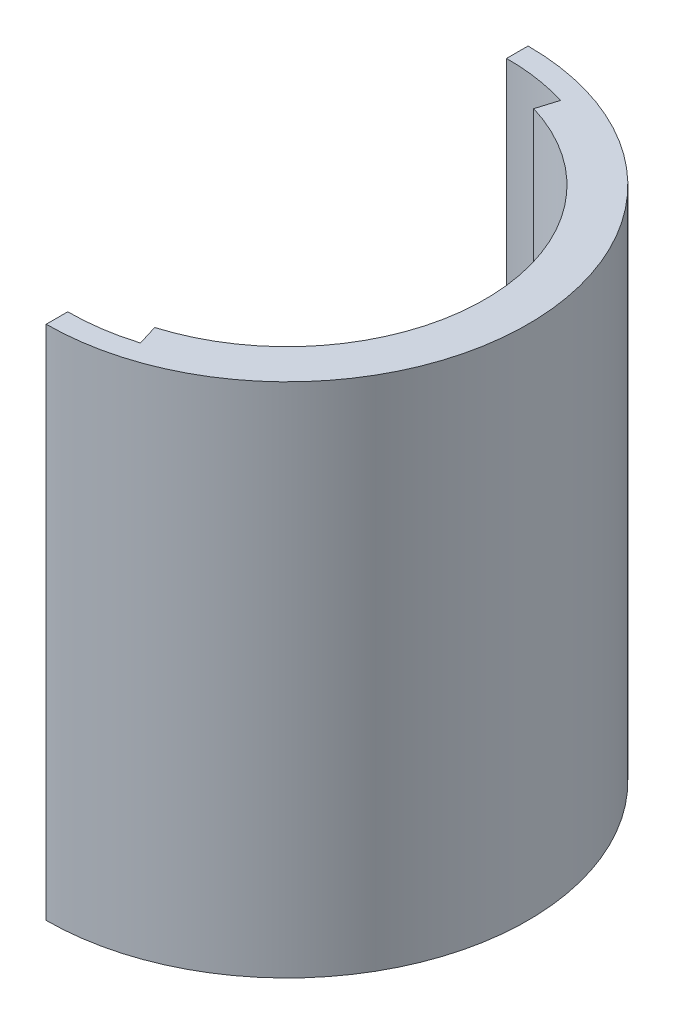
ISO-10303-21;
HEADER;
FILE_DESCRIPTION(('STEP AP214'),'2;1');
FILE_NAME('part.step','',(''),(''),'','','');
FILE_SCHEMA(('AUTOMOTIVE_DESIGN { 1 0 10303 214 1 1 1 1 }'));
ENDSEC;
DATA;
#1=APPLICATION_CONTEXT('core data for automotive mechanical design processes');
#2=APPLICATION_PROTOCOL_DEFINITION('international standard','automotive_design',2000,#1);
#3=PRODUCT_CONTEXT('',#1,'mechanical');
#4=PRODUCT('Part','Part','',(#3));
#5=PRODUCT_RELATED_PRODUCT_CATEGORY('part','',(#4));
#6=PRODUCT_DEFINITION_FORMATION('','',#4);
#7=PRODUCT_DEFINITION_CONTEXT('part definition',#1,'design');
#8=PRODUCT_DEFINITION('design','',#6,#7);
#9=PRODUCT_DEFINITION_SHAPE('','',#8);
#10=(LENGTH_UNIT() NAMED_UNIT(*) SI_UNIT(.MILLI.,.METRE.));
#11=(NAMED_UNIT(*) PLANE_ANGLE_UNIT() SI_UNIT($,.RADIAN.));
#12=(NAMED_UNIT(*) SI_UNIT($,.STERADIAN.) SOLID_ANGLE_UNIT());
#13=UNCERTAINTY_MEASURE_WITH_UNIT(LENGTH_MEASURE(1.E-05),#10,'distance_accuracy_value','');
#14=(GEOMETRIC_REPRESENTATION_CONTEXT(3) GLOBAL_UNCERTAINTY_ASSIGNED_CONTEXT((#13)) GLOBAL_UNIT_ASSIGNED_CONTEXT((#10,
#11,#12)) REPRESENTATION_CONTEXT('',''));
#15=CARTESIAN_POINT('',(0.,0.,0.));
#16=DIRECTION('',(0.,0.,1.));
#17=DIRECTION('',(1.,0.,0.));
#18=AXIS2_PLACEMENT_3D('',#15,#16,#17);
#19=CARTESIAN_POINT('',(0.,60.,0.));
#20=DIRECTION('',(0.,-1.,0.));
#21=DIRECTION('',(0.,0.,-1.));
#22=AXIS2_PLACEMENT_3D('',#19,#20,#21);
#23=CYLINDRICAL_SURFACE('',#22,23.);
#24=DIRECTION('',(0.,-1.,0.));
#25=VECTOR('',#24,1.);
#26=CARTESIAN_POINT('',(6.63401420516603,60.,22.0224852259152));
#27=LINE('',#26,#25);
#28=CARTESIAN_POINT('',(6.63401420516603,60.,22.0224852259152));
#29=VERTEX_POINT('',#28);
#30=CARTESIAN_POINT('',(6.63401420516603,0.,22.0224852259152));
#31=VERTEX_POINT('',#30);
#32=EDGE_CURVE('E52',#29,#31,#27,.T.);
#33=ORIENTED_EDGE('',*,*,#32,.F.);
#34=CARTESIAN_POINT('',(0.,60.,0.));
#35=DIRECTION('',(0.,-1.,0.));
#36=DIRECTION('',(0.,0.,-1.));
#37=AXIS2_PLACEMENT_3D('',#34,#35,#36);
#38=CIRCLE('',#37,23.);
#39=CARTESIAN_POINT('',(6.63401420516603,60.,-22.0224852259153));
#40=VERTEX_POINT('',#39);
#41=EDGE_CURVE('E128',#40,#29,#38,.T.);
#42=ORIENTED_EDGE('',*,*,#41,.F.);
#43=DIRECTION('',(0.,-1.,0.));
#44=VECTOR('',#43,1.);
#45=CARTESIAN_POINT('',(6.63401420516603,60.,-22.0224852259152));
#46=LINE('',#45,#44);
#47=CARTESIAN_POINT('',(6.63401420516603,0.,-22.0224852259152));
#48=VERTEX_POINT('',#47);
#49=EDGE_CURVE('E11',#40,#48,#46,.T.);
#50=ORIENTED_EDGE('',*,*,#49,.T.);
#51=CARTESIAN_POINT('',(0.,0.,0.));
#52=DIRECTION('',(0.,-1.,0.));
#53=DIRECTION('',(0.,0.,-1.));
#54=AXIS2_PLACEMENT_3D('',#51,#52,#53);
#55=CIRCLE('',#54,23.);
#56=EDGE_CURVE('E130',#48,#31,#55,.T.);
#57=ORIENTED_EDGE('',*,*,#56,.T.);
#58=EDGE_LOOP('',(#33,#42,#50,#57));
#59=FACE_BOUND('',#58,.T.);
#60=ADVANCED_FACE('F37',(#59),#23,.F.);
#61=CARTESIAN_POINT('',(0.,0.,0.));
#62=DIRECTION('',(0.,1.,0.));
#63=DIRECTION('',(0.,0.,1.));
#64=AXIS2_PLACEMENT_3D('',#61,#62,#63);
#65=PLANE('',#64);
#66=CARTESIAN_POINT('',(0.,0.,0.));
#67=DIRECTION('',(0.,1.,0.));
#68=DIRECTION('',(0.,0.,1.));
#69=AXIS2_PLACEMENT_3D('',#66,#67,#68);
#70=CIRCLE('',#69,28.);
#71=CARTESIAN_POINT('',(0.,0.,28.));
#72=VERTEX_POINT('',#71);
#73=CARTESIAN_POINT('',(0.,0.,-28.));
#74=VERTEX_POINT('',#73);
#75=EDGE_CURVE('E120',#72,#74,#70,.T.);
#76=ORIENTED_EDGE('',*,*,#75,.F.);
#77=DIRECTION('',(0.,0.,1.));
#78=VECTOR('',#77,1.);
#79=CARTESIAN_POINT('',(0.,0.,28.));
#80=LINE('',#79,#78);
#81=CARTESIAN_POINT('',(0.,0.,25.5));
#82=VERTEX_POINT('',#81);
#83=EDGE_CURVE('E113',#82,#72,#80,.T.);
#84=ORIENTED_EDGE('',*,*,#83,.F.);
#85=CARTESIAN_POINT('',(0.,0.,-2.22044604925031E-13));
#86=DIRECTION('',(0.,-1.,0.));
#87=DIRECTION('',(0.,0.,1.));
#88=AXIS2_PLACEMENT_3D('',#85,#86,#87);
#89=CIRCLE('',#88,25.5000000000002);
#90=CARTESIAN_POINT('',(7.36598579483397,0.,24.4129525717457));
#91=VERTEX_POINT('',#90);
#92=EDGE_CURVE('E145',#91,#82,#89,.T.);
#93=ORIENTED_EDGE('',*,*,#92,.F.);
#94=DIRECTION('',(0.292785906188586,0.,0.956178023768235));
#95=VECTOR('',#94,1.);
#96=CARTESIAN_POINT('',(7.36598579483397,0.,24.4129525717457));
#97=LINE('',#96,#95);
#98=EDGE_CURVE('E148',#31,#91,#97,.T.);
#99=ORIENTED_EDGE('',*,*,#98,.F.);
#100=ORIENTED_EDGE('',*,*,#56,.F.);
#101=DIRECTION('',(-0.292785906188586,0.,0.956178023768236));
#102=VECTOR('',#101,1.);
#103=CARTESIAN_POINT('',(6.63401420516603,0.,-22.0224852259152));
#104=LINE('',#103,#102);
#105=CARTESIAN_POINT('',(7.36597897063749,0.,-24.4129302853358));
#106=VERTEX_POINT('',#105);
#107=EDGE_CURVE('E150',#106,#48,#104,.T.);
#108=ORIENTED_EDGE('',*,*,#107,.F.);
#109=CARTESIAN_POINT('',(0.101596556702656,0.,-0.68896450134439));
#110=DIRECTION('',(0.,-1.,0.));
#111=DIRECTION('',(0.,0.,1.));
#112=AXIS2_PLACEMENT_3D('',#109,#110,#111);
#113=CIRCLE('',#112,24.8112435072465);
#114=CARTESIAN_POINT('',(0.,0.,-25.5));
#115=VERTEX_POINT('',#114);
#116=EDGE_CURVE('E152',#115,#106,#113,.T.);
#117=ORIENTED_EDGE('',*,*,#116,.F.);
#118=DIRECTION('',(0.,0.,1.));
#119=VECTOR('',#118,1.);
#120=CARTESIAN_POINT('',(0.,0.,-25.5));
#121=LINE('',#120,#119);
#122=EDGE_CURVE('E155',#74,#115,#121,.T.);
#123=ORIENTED_EDGE('',*,*,#122,.F.);
#124=EDGE_LOOP('',(#76,#84,#93,#99,#100,#108,#117,#123));
#125=FACE_BOUND('',#124,.T.);
#126=ADVANCED_FACE('F181',(#125),#65,.F.);
#127=CARTESIAN_POINT('',(0.,60.,0.));
#128=DIRECTION('',(0.,1.,0.));
#129=DIRECTION('',(0.,0.,1.));
#130=AXIS2_PLACEMENT_3D('',#127,#128,#129);
#131=PLANE('',#130);
#132=DIRECTION('',(0.,0.,1.));
#133=VECTOR('',#132,1.);
#134=CARTESIAN_POINT('',(0.,60.,28.));
#135=LINE('',#134,#133);
#136=CARTESIAN_POINT('',(0.,60.,25.5));
#137=VERTEX_POINT('',#136);
#138=CARTESIAN_POINT('',(0.,60.,28.));
#139=VERTEX_POINT('',#138);
#140=EDGE_CURVE('E121',#137,#139,#135,.T.);
#141=ORIENTED_EDGE('',*,*,#140,.T.);
#142=CARTESIAN_POINT('',(0.,60.,0.));
#143=DIRECTION('',(0.,1.,0.));
#144=DIRECTION('',(0.,0.,1.));
#145=AXIS2_PLACEMENT_3D('',#142,#143,#144);
#146=CIRCLE('',#145,28.);
#147=CARTESIAN_POINT('',(0.,60.,-28.));
#148=VERTEX_POINT('',#147);
#149=EDGE_CURVE('E45',#139,#148,#146,.T.);
#150=ORIENTED_EDGE('',*,*,#149,.T.);
#151=DIRECTION('',(0.,0.,1.));
#152=VECTOR('',#151,1.);
#153=CARTESIAN_POINT('',(0.,60.,-25.5));
#154=LINE('',#153,#152);
#155=CARTESIAN_POINT('',(0.,60.,-25.5));
#156=VERTEX_POINT('',#155);
#157=EDGE_CURVE('E101',#148,#156,#154,.T.);
#158=ORIENTED_EDGE('',*,*,#157,.T.);
#159=CARTESIAN_POINT('',(0.101596556702656,60.,-0.68896450134439));
#160=DIRECTION('',(0.,-1.,0.));
#161=DIRECTION('',(0.,0.,1.));
#162=AXIS2_PLACEMENT_3D('',#159,#160,#161);
#163=CIRCLE('',#162,24.8112435072465);
#164=CARTESIAN_POINT('',(7.36597897063749,60.,-24.4129302853358));
#165=VERTEX_POINT('',#164);
#166=EDGE_CURVE('E112',#156,#165,#163,.T.);
#167=ORIENTED_EDGE('',*,*,#166,.T.);
#168=DIRECTION('',(-0.292785906188586,0.,0.956178023768236));
#169=VECTOR('',#168,1.);
#170=CARTESIAN_POINT('',(6.63401420516603,60.,-22.0224852259152));
#171=LINE('',#170,#169);
#172=EDGE_CURVE('E163',#165,#40,#171,.T.);
#173=ORIENTED_EDGE('',*,*,#172,.T.);
#174=ORIENTED_EDGE('',*,*,#41,.T.);
#175=DIRECTION('',(0.292785906188586,0.,0.956178023768235));
#176=VECTOR('',#175,1.);
#177=CARTESIAN_POINT('',(7.36598579483397,60.,24.4129525717457));
#178=LINE('',#177,#176);
#179=CARTESIAN_POINT('',(7.36598579483397,60.,24.4129525717457));
#180=VERTEX_POINT('',#179);
#181=EDGE_CURVE('E160',#29,#180,#178,.T.);
#182=ORIENTED_EDGE('',*,*,#181,.T.);
#183=CARTESIAN_POINT('',(0.,60.,-2.22044604925031E-13));
#184=DIRECTION('',(0.,-1.,0.));
#185=DIRECTION('',(0.,0.,1.));
#186=AXIS2_PLACEMENT_3D('',#183,#184,#185);
#187=CIRCLE('',#186,25.5000000000002);
#188=EDGE_CURVE('E158',#180,#137,#187,.T.);
#189=ORIENTED_EDGE('',*,*,#188,.T.);
#190=EDGE_LOOP('',(#141,#150,#158,#167,#173,#174,#182,#189));
#191=FACE_BOUND('',#190,.T.);
#192=ADVANCED_FACE('F124',(#191),#131,.T.);
#193=CARTESIAN_POINT('',(0.,60.,0.));
#194=DIRECTION('',(0.,-1.,0.));
#195=DIRECTION('',(0.,0.,-1.));
#196=AXIS2_PLACEMENT_3D('',#193,#194,#195);
#197=CYLINDRICAL_SURFACE('',#196,28.);
#198=ORIENTED_EDGE('',*,*,#149,.F.);
#199=DIRECTION('',(0.,-1.,0.));
#200=VECTOR('',#199,1.);
#201=CARTESIAN_POINT('',(0.,60.,28.));
#202=LINE('',#201,#200);
#203=EDGE_CURVE('E132',#139,#72,#202,.T.);
#204=ORIENTED_EDGE('',*,*,#203,.T.);
#205=ORIENTED_EDGE('',*,*,#75,.T.);
#206=DIRECTION('',(0.,-1.,0.));
#207=VECTOR('',#206,1.);
#208=CARTESIAN_POINT('',(0.,60.,-28.));
#209=LINE('',#208,#207);
#210=EDGE_CURVE('E105',#148,#74,#209,.T.);
#211=ORIENTED_EDGE('',*,*,#210,.F.);
#212=EDGE_LOOP('',(#198,#204,#205,#211));
#213=FACE_BOUND('',#212,.T.);
#214=ADVANCED_FACE('F39',(#213),#197,.T.);
#215=CARTESIAN_POINT('',(6.63401420516603,60.,-22.0224852259152));
#216=DIRECTION('',(0.956178023768236,0.,0.292785906188586));
#217=DIRECTION('',(0.292785906188586,0.,-0.956178023768236));
#218=AXIS2_PLACEMENT_3D('',#215,#216,#217);
#219=PLANE('',#218);
#220=ORIENTED_EDGE('',*,*,#107,.T.);
#221=ORIENTED_EDGE('',*,*,#49,.F.);
#222=ORIENTED_EDGE('',*,*,#172,.F.);
#223=DIRECTION('',(0.,-1.,0.));
#224=VECTOR('',#223,1.);
#225=CARTESIAN_POINT('',(7.36597897063749,60.,-24.4129302853358));
#226=LINE('',#225,#224);
#227=EDGE_CURVE('E136',#165,#106,#226,.T.);
#228=ORIENTED_EDGE('',*,*,#227,.T.);
#229=EDGE_LOOP('',(#220,#221,#222,#228));
#230=FACE_BOUND('',#229,.T.);
#231=ADVANCED_FACE('F170',(#230),#219,.F.);
#232=CARTESIAN_POINT('',(0.,60.,-25.5));
#233=DIRECTION('',(1.,0.,0.));
#234=DIRECTION('',(0.,0.,-1.));
#235=AXIS2_PLACEMENT_3D('',#232,#233,#234);
#236=PLANE('',#235);
#237=ORIENTED_EDGE('',*,*,#122,.T.);
#238=DIRECTION('',(0.,-1.,0.));
#239=VECTOR('',#238,1.);
#240=CARTESIAN_POINT('',(0.,60.,-25.5));
#241=LINE('',#240,#239);
#242=EDGE_CURVE('E107',#156,#115,#241,.T.);
#243=ORIENTED_EDGE('',*,*,#242,.F.);
#244=ORIENTED_EDGE('',*,*,#157,.F.);
#245=ORIENTED_EDGE('',*,*,#210,.T.);
#246=EDGE_LOOP('',(#237,#243,#244,#245));
#247=FACE_BOUND('',#246,.T.);
#248=ADVANCED_FACE('F104',(#247),#236,.F.);
#249=CARTESIAN_POINT('',(0.101596556702656,60.,-0.68896450134439));
#250=DIRECTION('',(0.,-1.,0.));
#251=DIRECTION('',(0.,0.,-1.));
#252=AXIS2_PLACEMENT_3D('',#249,#250,#251);
#253=CYLINDRICAL_SURFACE('',#252,24.8112435072465);
#254=ORIENTED_EDGE('',*,*,#116,.T.);
#255=ORIENTED_EDGE('',*,*,#227,.F.);
#256=ORIENTED_EDGE('',*,*,#166,.F.);
#257=ORIENTED_EDGE('',*,*,#242,.T.);
#258=EDGE_LOOP('',(#254,#255,#256,#257));
#259=FACE_BOUND('',#258,.T.);
#260=ADVANCED_FACE('F167',(#259),#253,.F.);
#261=CARTESIAN_POINT('',(0.,60.,28.));
#262=DIRECTION('',(1.,0.,0.));
#263=DIRECTION('',(0.,0.,-1.));
#264=AXIS2_PLACEMENT_3D('',#261,#262,#263);
#265=PLANE('',#264);
#266=ORIENTED_EDGE('',*,*,#83,.T.);
#267=ORIENTED_EDGE('',*,*,#203,.F.);
#268=ORIENTED_EDGE('',*,*,#140,.F.);
#269=DIRECTION('',(0.,-1.,0.));
#270=VECTOR('',#269,1.);
#271=CARTESIAN_POINT('',(0.,60.,25.5));
#272=LINE('',#271,#270);
#273=EDGE_CURVE('E141',#137,#82,#272,.T.);
#274=ORIENTED_EDGE('',*,*,#273,.T.);
#275=EDGE_LOOP('',(#266,#267,#268,#274));
#276=FACE_BOUND('',#275,.T.);
#277=ADVANCED_FACE('F218',(#276),#265,.F.);
#278=CARTESIAN_POINT('',(0.,60.,-2.22044604925031E-13));
#279=DIRECTION('',(0.,-1.,0.));
#280=DIRECTION('',(0.,0.,-1.));
#281=AXIS2_PLACEMENT_3D('',#278,#279,#280);
#282=CYLINDRICAL_SURFACE('',#281,25.5000000000002);
#283=ORIENTED_EDGE('',*,*,#92,.T.);
#284=ORIENTED_EDGE('',*,*,#273,.F.);
#285=ORIENTED_EDGE('',*,*,#188,.F.);
#286=DIRECTION('',(0.,-1.,0.));
#287=VECTOR('',#286,1.);
#288=CARTESIAN_POINT('',(7.36598579483397,60.,24.4129525717457));
#289=LINE('',#288,#287);
#290=EDGE_CURVE('E139',#180,#91,#289,.T.);
#291=ORIENTED_EDGE('',*,*,#290,.T.);
#292=EDGE_LOOP('',(#283,#284,#285,#291));
#293=FACE_BOUND('',#292,.T.);
#294=ADVANCED_FACE('F226',(#293),#282,.F.);
#295=CARTESIAN_POINT('',(7.36598579483397,60.,24.4129525717457));
#296=DIRECTION('',(0.956178023768235,0.,-0.292785906188586));
#297=DIRECTION('',(-0.292785906188586,0.,-0.956178023768236));
#298=AXIS2_PLACEMENT_3D('',#295,#296,#297);
#299=PLANE('',#298);
#300=ORIENTED_EDGE('',*,*,#98,.T.);
#301=ORIENTED_EDGE('',*,*,#290,.F.);
#302=ORIENTED_EDGE('',*,*,#181,.F.);
#303=ORIENTED_EDGE('',*,*,#32,.T.);
#304=EDGE_LOOP('',(#300,#301,#302,#303));
#305=FACE_BOUND('',#304,.T.);
#306=ADVANCED_FACE('F236',(#305),#299,.F.);
#307=CLOSED_SHELL('',(#60,#126,#192,#214,#231,#248,#260,#277,#294,#306));
#308=MANIFOLD_SOLID_BREP('B2',#307);
#309=ADVANCED_BREP_SHAPE_REPRESENTATION('',(#18,#308),#14);
#310=SHAPE_DEFINITION_REPRESENTATION(#9,#309);
ENDSEC;
END-ISO-10303-21;
